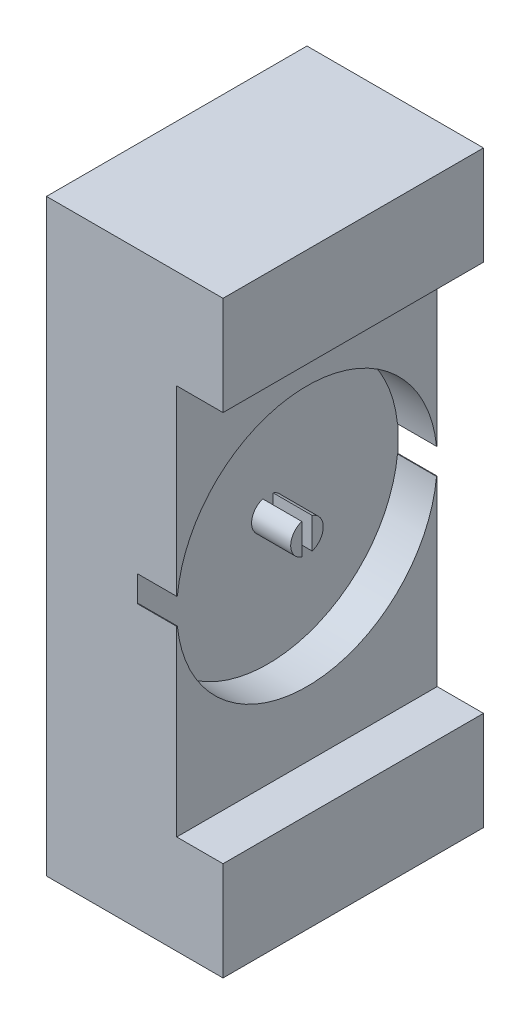
ISO-10303-21;
HEADER;
FILE_DESCRIPTION(('STEP AP214'),'2;1');
FILE_NAME('part.step','',(''),(''),'','','');
FILE_SCHEMA(('AUTOMOTIVE_DESIGN { 1 0 10303 214 1 1 1 1 }'));
ENDSEC;
DATA;
#1=APPLICATION_CONTEXT('core data for automotive mechanical design processes');
#2=APPLICATION_PROTOCOL_DEFINITION('international standard','automotive_design',2000,#1);
#3=PRODUCT_CONTEXT('',#1,'mechanical');
#4=PRODUCT('Part','Part','',(#3));
#5=PRODUCT_RELATED_PRODUCT_CATEGORY('part','',(#4));
#6=PRODUCT_DEFINITION_FORMATION('','',#4);
#7=PRODUCT_DEFINITION_CONTEXT('part definition',#1,'design');
#8=PRODUCT_DEFINITION('design','',#6,#7);
#9=PRODUCT_DEFINITION_SHAPE('','',#8);
#10=(LENGTH_UNIT() NAMED_UNIT(*) SI_UNIT(.MILLI.,.METRE.));
#11=(NAMED_UNIT(*) PLANE_ANGLE_UNIT() SI_UNIT($,.RADIAN.));
#12=(NAMED_UNIT(*) SI_UNIT($,.STERADIAN.) SOLID_ANGLE_UNIT());
#13=UNCERTAINTY_MEASURE_WITH_UNIT(LENGTH_MEASURE(1.E-05),#10,'distance_accuracy_value','');
#14=(GEOMETRIC_REPRESENTATION_CONTEXT(3) GLOBAL_UNCERTAINTY_ASSIGNED_CONTEXT((#13)) GLOBAL_UNIT_ASSIGNED_CONTEXT((#10,
#11,#12)) REPRESENTATION_CONTEXT('',''));
#15=CARTESIAN_POINT('',(0.,0.,0.));
#16=DIRECTION('',(0.,0.,1.));
#17=DIRECTION('',(1.,0.,0.));
#18=AXIS2_PLACEMENT_3D('',#15,#16,#17);
#19=CARTESIAN_POINT('',(-15.,0.,50.));
#20=DIRECTION('',(-1.,0.,0.));
#21=DIRECTION('',(0.,0.,1.));
#22=AXIS2_PLACEMENT_3D('',#19,#20,#21);
#23=PLANE('',#22);
#24=CARTESIAN_POINT('',(-15.,113.,0.));
#25=DIRECTION('',(1.,0.,0.));
#26=DIRECTION('',(0.,0.,-1.));
#27=AXIS2_PLACEMENT_3D('',#24,#25,#26);
#28=CIRCLE('',#27,6.25000000000001);
#29=CARTESIAN_POINT('',(-15.,118.921359641164,2.00000000000001));
#30=VERTEX_POINT('',#29);
#31=CARTESIAN_POINT('',(-15.,107.078640358837,2.00000000000001));
#32=VERTEX_POINT('',#31);
#33=EDGE_CURVE('E466',#30,#32,#28,.T.);
#34=ORIENTED_EDGE('',*,*,#33,.F.);
#35=DIRECTION('',(0.,-1.,0.));
#36=VECTOR('',#35,1.);
#37=CARTESIAN_POINT('',(-15.,118.921359641164,2.00000000000001));
#38=LINE('',#37,#36);
#39=EDGE_CURVE('E464',#30,#32,#38,.T.);
#40=ORIENTED_EDGE('',*,*,#39,.T.);
#41=EDGE_LOOP('',(#34,#40));
#42=FACE_BOUND('',#41,.T.);
#43=DIRECTION('',(0.,0.,-1.));
#44=VECTOR('',#43,1.);
#45=CARTESIAN_POINT('',(-15.,118.,0.));
#46=LINE('',#45,#44);
#47=CARTESIAN_POINT('',(-15.,118.,-49.749371855331));
#48=VERTEX_POINT('',#47);
#49=CARTESIAN_POINT('',(-15.,118.,-50.));
#50=VERTEX_POINT('',#49);
#51=EDGE_CURVE('E488',#48,#50,#46,.T.);
#52=ORIENTED_EDGE('',*,*,#51,.F.);
#53=CARTESIAN_POINT('',(-15.,113.,0.));
#54=DIRECTION('',(1.,0.,0.));
#55=DIRECTION('',(0.,0.,-1.));
#56=AXIS2_PLACEMENT_3D('',#53,#54,#55);
#57=CIRCLE('',#56,50.);
#58=CARTESIAN_POINT('',(-15.,118.,49.749371855331));
#59=VERTEX_POINT('',#58);
#60=EDGE_CURVE('E491',#48,#59,#57,.T.);
#61=ORIENTED_EDGE('',*,*,#60,.T.);
#62=CARTESIAN_POINT('',(-15.,118.,50.));
#63=VERTEX_POINT('',#62);
#64=EDGE_CURVE('E492',#63,#59,#46,.T.);
#65=ORIENTED_EDGE('',*,*,#64,.F.);
#66=DIRECTION('',(0.,1.,0.));
#67=VECTOR('',#66,1.);
#68=CARTESIAN_POINT('',(-15.,0.,50.));
#69=LINE('',#68,#67);
#70=CARTESIAN_POINT('',(-15.,108.,50.));
#71=VERTEX_POINT('',#70);
#72=EDGE_CURVE('E539',#71,#63,#69,.T.);
#73=ORIENTED_EDGE('',*,*,#72,.F.);
#74=DIRECTION('',(0.,0.,-1.));
#75=VECTOR('',#74,1.);
#76=CARTESIAN_POINT('',(-15.,108.,0.));
#77=LINE('',#76,#75);
#78=CARTESIAN_POINT('',(-15.,108.,49.749371855331));
#79=VERTEX_POINT('',#78);
#80=EDGE_CURVE('E525',#71,#79,#77,.T.);
#81=ORIENTED_EDGE('',*,*,#80,.T.);
#82=CARTESIAN_POINT('',(-15.,113.,0.));
#83=DIRECTION('',(1.,0.,0.));
#84=DIRECTION('',(0.,0.,-1.));
#85=AXIS2_PLACEMENT_3D('',#82,#83,#84);
#86=CIRCLE('',#85,50.);
#87=CARTESIAN_POINT('',(-15.,108.,-49.749371855331));
#88=VERTEX_POINT('',#87);
#89=EDGE_CURVE('E494',#79,#88,#86,.T.);
#90=ORIENTED_EDGE('',*,*,#89,.T.);
#91=CARTESIAN_POINT('',(-15.,108.,-50.));
#92=VERTEX_POINT('',#91);
#93=EDGE_CURVE('E511',#88,#92,#77,.T.);
#94=ORIENTED_EDGE('',*,*,#93,.T.);
#95=DIRECTION('',(0.,1.,0.));
#96=VECTOR('',#95,1.);
#97=CARTESIAN_POINT('',(-15.,0.,-50.));
#98=LINE('',#97,#96);
#99=EDGE_CURVE('E543',#92,#50,#98,.T.);
#100=ORIENTED_EDGE('',*,*,#99,.T.);
#101=EDGE_LOOP('',(#52,#61,#65,#73,#81,#90,#94,#100));
#102=FACE_BOUND('',#101,.T.);
#103=DIRECTION('',(0.,-1.,0.));
#104=VECTOR('',#103,1.);
#105=CARTESIAN_POINT('',(-15.,118.921359641164,-1.99999999999999));
#106=LINE('',#105,#104);
#107=CARTESIAN_POINT('',(-15.,118.921359641164,-1.99999999999999));
#108=VERTEX_POINT('',#107);
#109=CARTESIAN_POINT('',(-15.,107.078640358837,-1.99999999999999));
#110=VERTEX_POINT('',#109);
#111=EDGE_CURVE('E447',#108,#110,#106,.T.);
#112=ORIENTED_EDGE('',*,*,#111,.F.);
#113=CARTESIAN_POINT('',(-15.,113.,0.));
#114=DIRECTION('',(-1.,0.,0.));
#115=DIRECTION('',(0.,0.,1.));
#116=AXIS2_PLACEMENT_3D('',#113,#114,#115);
#117=CIRCLE('',#116,6.25000000000001);
#118=EDGE_CURVE('E450',#108,#110,#117,.T.);
#119=ORIENTED_EDGE('',*,*,#118,.T.);
#120=EDGE_LOOP('',(#112,#119));
#121=FACE_BOUND('',#120,.T.);
#122=ADVANCED_FACE('F250',(#42,#102,#121),#23,.F.);
#123=CARTESIAN_POINT('',(-50.,226.,-50.));
#124=DIRECTION('',(0.,0.,1.));
#125=DIRECTION('',(1.,0.,0.));
#126=AXIS2_PLACEMENT_3D('',#123,#124,#125);
#127=PLANE('',#126);
#128=DIRECTION('',(-1.,0.,0.));
#129=VECTOR('',#128,1.);
#130=CARTESIAN_POINT('',(-50.,226.,-50.));
#131=LINE('',#130,#129);
#132=CARTESIAN_POINT('',(17.7780341365237,226.,-50.));
#133=VERTEX_POINT('',#132);
#134=CARTESIAN_POINT('',(-50.,226.,-50.));
#135=VERTEX_POINT('',#134);
#136=EDGE_CURVE('E396',#133,#135,#131,.T.);
#137=ORIENTED_EDGE('',*,*,#136,.F.);
#138=DIRECTION('',(0.,-1.,0.));
#139=VECTOR('',#138,1.);
#140=CARTESIAN_POINT('',(17.7780341365237,226.,-50.));
#141=LINE('',#140,#139);
#142=CARTESIAN_POINT('',(17.7780341365237,188.,-50.));
#143=VERTEX_POINT('',#142);
#144=EDGE_CURVE('E384',#133,#143,#141,.T.);
#145=ORIENTED_EDGE('',*,*,#144,.T.);
#146=DIRECTION('',(1.,0.,0.));
#147=VECTOR('',#146,1.);
#148=CARTESIAN_POINT('',(1.48662342328725E-13,188.,-50.));
#149=LINE('',#148,#147);
#150=CARTESIAN_POINT('',(0.,188.,-50.));
#151=VERTEX_POINT('',#150);
#152=EDGE_CURVE('E412',#151,#143,#149,.T.);
#153=ORIENTED_EDGE('',*,*,#152,.F.);
#154=DIRECTION('',(0.,1.,0.));
#155=VECTOR('',#154,1.);
#156=CARTESIAN_POINT('',(0.,0.,-50.));
#157=LINE('',#156,#155);
#158=CARTESIAN_POINT('',(0.,118.,-50.));
#159=VERTEX_POINT('',#158);
#160=EDGE_CURVE('E499',#159,#151,#157,.T.);
#161=ORIENTED_EDGE('',*,*,#160,.F.);
#162=DIRECTION('',(-1.,0.,0.));
#163=VECTOR('',#162,1.);
#164=CARTESIAN_POINT('',(0.,118.,-50.));
#165=LINE('',#164,#163);
#166=EDGE_CURVE('E478',#159,#50,#165,.T.);
#167=ORIENTED_EDGE('',*,*,#166,.T.);
#168=ORIENTED_EDGE('',*,*,#99,.F.);
#169=DIRECTION('',(-1.,0.,0.));
#170=VECTOR('',#169,1.);
#171=CARTESIAN_POINT('',(0.,108.,-50.));
#172=LINE('',#171,#170);
#173=CARTESIAN_POINT('',(0.,108.,-50.));
#174=VERTEX_POINT('',#173);
#175=EDGE_CURVE('E530',#174,#92,#172,.T.);
#176=ORIENTED_EDGE('',*,*,#175,.F.);
#177=DIRECTION('',(0.,1.,0.));
#178=VECTOR('',#177,1.);
#179=CARTESIAN_POINT('',(0.,0.,-50.));
#180=LINE('',#179,#178);
#181=CARTESIAN_POINT('',(0.,38.,-50.));
#182=VERTEX_POINT('',#181);
#183=EDGE_CURVE('E521',#182,#174,#180,.T.);
#184=ORIENTED_EDGE('',*,*,#183,.F.);
#185=DIRECTION('',(-1.,0.,0.));
#186=VECTOR('',#185,1.);
#187=CARTESIAN_POINT('',(0.,38.,-50.));
#188=LINE('',#187,#186);
#189=CARTESIAN_POINT('',(17.7780341365237,38.,-50.));
#190=VERTEX_POINT('',#189);
#191=EDGE_CURVE('E536',#190,#182,#188,.T.);
#192=ORIENTED_EDGE('',*,*,#191,.F.);
#193=CARTESIAN_POINT('',(17.7780341365237,0.,-50.));
#194=VERTEX_POINT('',#193);
#195=EDGE_CURVE('E265',#190,#194,#141,.T.);
#196=ORIENTED_EDGE('',*,*,#195,.T.);
#197=DIRECTION('',(-1.,0.,0.));
#198=VECTOR('',#197,1.);
#199=CARTESIAN_POINT('',(-50.,0.,-50.));
#200=LINE('',#199,#198);
#201=CARTESIAN_POINT('',(-50.,0.,-50.));
#202=VERTEX_POINT('',#201);
#203=EDGE_CURVE('E417',#194,#202,#200,.T.);
#204=ORIENTED_EDGE('',*,*,#203,.T.);
#205=DIRECTION('',(0.,-1.,0.));
#206=VECTOR('',#205,1.);
#207=CARTESIAN_POINT('',(-50.,226.,-50.));
#208=LINE('',#207,#206);
#209=EDGE_CURVE('E258',#135,#202,#208,.T.);
#210=ORIENTED_EDGE('',*,*,#209,.F.);
#211=EDGE_LOOP('',(#137,#145,#153,#161,#167,#168,#176,#184,#192,#196,#204,#210));
#212=FACE_BOUND('',#211,.T.);
#213=ADVANCED_FACE('F252',(#212),#127,.F.);
#214=CARTESIAN_POINT('',(-50.,226.,-50.));
#215=DIRECTION('',(1.,0.,0.));
#216=DIRECTION('',(0.,0.,-1.));
#217=AXIS2_PLACEMENT_3D('',#214,#215,#216);
#218=PLANE('',#217);
#219=DIRECTION('',(0.,0.,1.));
#220=VECTOR('',#219,1.);
#221=CARTESIAN_POINT('',(-50.,0.,-50.));
#222=LINE('',#221,#220);
#223=CARTESIAN_POINT('',(-50.,0.,50.));
#224=VERTEX_POINT('',#223);
#225=EDGE_CURVE('E409',#202,#224,#222,.T.);
#226=ORIENTED_EDGE('',*,*,#225,.T.);
#227=DIRECTION('',(0.,-1.,0.));
#228=VECTOR('',#227,1.);
#229=CARTESIAN_POINT('',(-50.,226.,50.));
#230=LINE('',#229,#228);
#231=CARTESIAN_POINT('',(-50.,226.,50.));
#232=VERTEX_POINT('',#231);
#233=EDGE_CURVE('E416',#232,#224,#230,.T.);
#234=ORIENTED_EDGE('',*,*,#233,.F.);
#235=DIRECTION('',(0.,0.,1.));
#236=VECTOR('',#235,1.);
#237=CARTESIAN_POINT('',(-50.,226.,-50.));
#238=LINE('',#237,#236);
#239=EDGE_CURVE('E404',#135,#232,#238,.T.);
#240=ORIENTED_EDGE('',*,*,#239,.F.);
#241=ORIENTED_EDGE('',*,*,#209,.T.);
#242=EDGE_LOOP('',(#226,#234,#240,#241));
#243=FACE_BOUND('',#242,.T.);
#244=ADVANCED_FACE('F424',(#243),#218,.F.);
#245=CARTESIAN_POINT('',(-50.,226.,50.));
#246=DIRECTION('',(0.,0.,-1.));
#247=DIRECTION('',(-1.,0.,0.));
#248=AXIS2_PLACEMENT_3D('',#245,#246,#247);
#249=PLANE('',#248);
#250=DIRECTION('',(1.,0.,0.));
#251=VECTOR('',#250,1.);
#252=CARTESIAN_POINT('',(-50.,0.,50.));
#253=LINE('',#252,#251);
#254=CARTESIAN_POINT('',(17.7780341365237,0.,50.));
#255=VERTEX_POINT('',#254);
#256=EDGE_CURVE('E405',#224,#255,#253,.T.);
#257=ORIENTED_EDGE('',*,*,#256,.T.);
#258=DIRECTION('',(0.,-1.,0.));
#259=VECTOR('',#258,1.);
#260=CARTESIAN_POINT('',(17.7780341365237,226.,50.));
#261=LINE('',#260,#259);
#262=CARTESIAN_POINT('',(17.7780341365237,38.,50.));
#263=VERTEX_POINT('',#262);
#264=EDGE_CURVE('E434',#263,#255,#261,.T.);
#265=ORIENTED_EDGE('',*,*,#264,.F.);
#266=DIRECTION('',(-1.,0.,0.));
#267=VECTOR('',#266,1.);
#268=CARTESIAN_POINT('',(0.,38.,50.));
#269=LINE('',#268,#267);
#270=CARTESIAN_POINT('',(0.,38.,50.));
#271=VERTEX_POINT('',#270);
#272=EDGE_CURVE('E537',#263,#271,#269,.T.);
#273=ORIENTED_EDGE('',*,*,#272,.T.);
#274=DIRECTION('',(0.,1.,0.));
#275=VECTOR('',#274,1.);
#276=CARTESIAN_POINT('',(0.,0.,50.));
#277=LINE('',#276,#275);
#278=CARTESIAN_POINT('',(0.,108.,50.));
#279=VERTEX_POINT('',#278);
#280=EDGE_CURVE('E514',#271,#279,#277,.T.);
#281=ORIENTED_EDGE('',*,*,#280,.T.);
#282=DIRECTION('',(-1.,0.,0.));
#283=VECTOR('',#282,1.);
#284=CARTESIAN_POINT('',(0.,108.,50.));
#285=LINE('',#284,#283);
#286=EDGE_CURVE('E532',#279,#71,#285,.T.);
#287=ORIENTED_EDGE('',*,*,#286,.T.);
#288=ORIENTED_EDGE('',*,*,#72,.T.);
#289=DIRECTION('',(-1.,0.,0.));
#290=VECTOR('',#289,1.);
#291=CARTESIAN_POINT('',(0.,118.,50.));
#292=LINE('',#291,#290);
#293=CARTESIAN_POINT('',(0.,118.,50.));
#294=VERTEX_POINT('',#293);
#295=EDGE_CURVE('E481',#294,#63,#292,.T.);
#296=ORIENTED_EDGE('',*,*,#295,.F.);
#297=DIRECTION('',(0.,1.,0.));
#298=VECTOR('',#297,1.);
#299=CARTESIAN_POINT('',(0.,0.,50.));
#300=LINE('',#299,#298);
#301=CARTESIAN_POINT('',(0.,188.,50.));
#302=VERTEX_POINT('',#301);
#303=EDGE_CURVE('E495',#294,#302,#300,.T.);
#304=ORIENTED_EDGE('',*,*,#303,.T.);
#305=DIRECTION('',(1.,0.,0.));
#306=VECTOR('',#305,1.);
#307=CARTESIAN_POINT('',(1.48662342328725E-13,188.,50.));
#308=LINE('',#307,#306);
#309=CARTESIAN_POINT('',(17.7780341365237,188.,50.));
#310=VERTEX_POINT('',#309);
#311=EDGE_CURVE('E419',#302,#310,#308,.T.);
#312=ORIENTED_EDGE('',*,*,#311,.T.);
#313=CARTESIAN_POINT('',(17.7780341365237,226.,50.));
#314=VERTEX_POINT('',#313);
#315=EDGE_CURVE('E273',#314,#310,#261,.T.);
#316=ORIENTED_EDGE('',*,*,#315,.F.);
#317=DIRECTION('',(1.,0.,0.));
#318=VECTOR('',#317,1.);
#319=CARTESIAN_POINT('',(-50.,226.,50.));
#320=LINE('',#319,#318);
#321=EDGE_CURVE('E399',#232,#314,#320,.T.);
#322=ORIENTED_EDGE('',*,*,#321,.F.);
#323=ORIENTED_EDGE('',*,*,#233,.T.);
#324=EDGE_LOOP('',(#257,#265,#273,#281,#287,#288,#296,#304,#312,#316,#322,#323));
#325=FACE_BOUND('',#324,.T.);
#326=ADVANCED_FACE('F433',(#325),#249,.F.);
#327=CARTESIAN_POINT('',(0.,226.,0.));
#328=DIRECTION('',(0.,1.,0.));
#329=DIRECTION('',(0.,0.,1.));
#330=AXIS2_PLACEMENT_3D('',#327,#328,#329);
#331=PLANE('',#330);
#332=DIRECTION('',(0.,0.,1.));
#333=VECTOR('',#332,1.);
#334=CARTESIAN_POINT('',(17.7780341365237,226.,-50.));
#335=LINE('',#334,#333);
#336=EDGE_CURVE('E387',#133,#314,#335,.T.);
#337=ORIENTED_EDGE('',*,*,#336,.F.);
#338=ORIENTED_EDGE('',*,*,#136,.T.);
#339=ORIENTED_EDGE('',*,*,#239,.T.);
#340=ORIENTED_EDGE('',*,*,#321,.T.);
#341=EDGE_LOOP('',(#337,#338,#339,#340));
#342=FACE_BOUND('',#341,.T.);
#343=ADVANCED_FACE('F395',(#342),#331,.T.);
#344=CARTESIAN_POINT('',(0.,0.,0.));
#345=DIRECTION('',(0.,1.,0.));
#346=DIRECTION('',(0.,0.,1.));
#347=AXIS2_PLACEMENT_3D('',#344,#345,#346);
#348=PLANE('',#347);
#349=ORIENTED_EDGE('',*,*,#203,.F.);
#350=DIRECTION('',(0.,0.,1.));
#351=VECTOR('',#350,1.);
#352=CARTESIAN_POINT('',(17.7780341365237,0.,-50.));
#353=LINE('',#352,#351);
#354=EDGE_CURVE('E400',#194,#255,#353,.T.);
#355=ORIENTED_EDGE('',*,*,#354,.T.);
#356=ORIENTED_EDGE('',*,*,#256,.F.);
#357=ORIENTED_EDGE('',*,*,#225,.F.);
#358=EDGE_LOOP('',(#349,#355,#356,#357));
#359=FACE_BOUND('',#358,.T.);
#360=ADVANCED_FACE('F429',(#359),#348,.F.);
#361=CARTESIAN_POINT('',(0.,38.,50.));
#362=DIRECTION('',(0.,-1.,0.));
#363=DIRECTION('',(1.,0.,0.));
#364=AXIS2_PLACEMENT_3D('',#361,#362,#363);
#365=PLANE('',#364);
#366=ORIENTED_EDGE('',*,*,#272,.F.);
#367=DIRECTION('',(0.,0.,-1.));
#368=VECTOR('',#367,1.);
#369=CARTESIAN_POINT('',(17.7780341365237,38.,50.));
#370=LINE('',#369,#368);
#371=EDGE_CURVE('E440',#263,#190,#370,.T.);
#372=ORIENTED_EDGE('',*,*,#371,.T.);
#373=ORIENTED_EDGE('',*,*,#191,.T.);
#374=DIRECTION('',(0.,0.,-1.));
#375=VECTOR('',#374,1.);
#376=CARTESIAN_POINT('',(0.,38.,0.));
#377=LINE('',#376,#375);
#378=EDGE_CURVE('E518',#271,#182,#377,.T.);
#379=ORIENTED_EDGE('',*,*,#378,.F.);
#380=EDGE_LOOP('',(#366,#372,#373,#379));
#381=FACE_BOUND('',#380,.T.);
#382=ADVANCED_FACE('F574',(#381),#365,.F.);
#383=CARTESIAN_POINT('',(1.48662342328725E-13,188.,50.));
#384=DIRECTION('',(0.,1.,0.));
#385=DIRECTION('',(-1.,0.,0.));
#386=AXIS2_PLACEMENT_3D('',#383,#384,#385);
#387=PLANE('',#386);
#388=ORIENTED_EDGE('',*,*,#152,.T.);
#389=DIRECTION('',(0.,0.,1.));
#390=VECTOR('',#389,1.);
#391=CARTESIAN_POINT('',(17.7780341365237,188.,50.));
#392=LINE('',#391,#390);
#393=EDGE_CURVE('E12',#143,#310,#392,.T.);
#394=ORIENTED_EDGE('',*,*,#393,.T.);
#395=ORIENTED_EDGE('',*,*,#311,.F.);
#396=DIRECTION('',(0.,0.,-1.));
#397=VECTOR('',#396,1.);
#398=CARTESIAN_POINT('',(0.,188.,0.));
#399=LINE('',#398,#397);
#400=EDGE_CURVE('E497',#302,#151,#399,.T.);
#401=ORIENTED_EDGE('',*,*,#400,.T.);
#402=EDGE_LOOP('',(#388,#394,#395,#401));
#403=FACE_BOUND('',#402,.T.);
#404=ADVANCED_FACE('F548',(#403),#387,.F.);
#405=CARTESIAN_POINT('',(0.,113.,0.));
#406=DIRECTION('',(-1.,0.,0.));
#407=DIRECTION('',(0.,0.,1.));
#408=AXIS2_PLACEMENT_3D('',#405,#406,#407);
#409=CYLINDRICAL_SURFACE('',#408,50.);
#410=ORIENTED_EDGE('',*,*,#89,.F.);
#411=DIRECTION('',(-1.,0.,0.));
#412=VECTOR('',#411,1.);
#413=CARTESIAN_POINT('',(0.,108.,49.749371855331));
#414=LINE('',#413,#412);
#415=CARTESIAN_POINT('',(0.,108.,49.749371855331));
#416=VERTEX_POINT('',#415);
#417=EDGE_CURVE('E534',#416,#79,#414,.T.);
#418=ORIENTED_EDGE('',*,*,#417,.F.);
#419=CARTESIAN_POINT('',(0.,113.,0.));
#420=DIRECTION('',(1.,0.,0.));
#421=DIRECTION('',(0.,0.,-1.));
#422=AXIS2_PLACEMENT_3D('',#419,#420,#421);
#423=CIRCLE('',#422,50.);
#424=CARTESIAN_POINT('',(0.,108.,-49.749371855331));
#425=VERTEX_POINT('',#424);
#426=EDGE_CURVE('E507',#416,#425,#423,.T.);
#427=ORIENTED_EDGE('',*,*,#426,.T.);
#428=DIRECTION('',(-1.,0.,0.));
#429=VECTOR('',#428,1.);
#430=CARTESIAN_POINT('',(0.,108.,-49.749371855331));
#431=LINE('',#430,#429);
#432=EDGE_CURVE('E528',#425,#88,#431,.T.);
#433=ORIENTED_EDGE('',*,*,#432,.T.);
#434=EDGE_LOOP('',(#410,#418,#427,#433));
#435=FACE_BOUND('',#434,.T.);
#436=ADVANCED_FACE('F626',(#435),#409,.F.);
#437=CARTESIAN_POINT('',(0.,108.,0.));
#438=DIRECTION('',(0.,1.,0.));
#439=DIRECTION('',(0.,0.,1.));
#440=AXIS2_PLACEMENT_3D('',#437,#438,#439);
#441=PLANE('',#440);
#442=ORIENTED_EDGE('',*,*,#80,.F.);
#443=ORIENTED_EDGE('',*,*,#286,.F.);
#444=DIRECTION('',(0.,0.,-1.));
#445=VECTOR('',#444,1.);
#446=CARTESIAN_POINT('',(0.,108.,0.));
#447=LINE('',#446,#445);
#448=EDGE_CURVE('E510',#279,#416,#447,.T.);
#449=ORIENTED_EDGE('',*,*,#448,.T.);
#450=ORIENTED_EDGE('',*,*,#417,.T.);
#451=EDGE_LOOP('',(#442,#443,#449,#450));
#452=FACE_BOUND('',#451,.T.);
#453=ADVANCED_FACE('F632',(#452),#441,.T.);
#454=ORIENTED_EDGE('',*,*,#93,.F.);
#455=ORIENTED_EDGE('',*,*,#432,.F.);
#456=EDGE_CURVE('E515',#425,#174,#447,.T.);
#457=ORIENTED_EDGE('',*,*,#456,.T.);
#458=ORIENTED_EDGE('',*,*,#175,.T.);
#459=EDGE_LOOP('',(#454,#455,#457,#458));
#460=FACE_BOUND('',#459,.T.);
#461=ADVANCED_FACE('F566',(#460),#441,.T.);
#462=CARTESIAN_POINT('',(0.,0.,0.));
#463=DIRECTION('',(1.,0.,0.));
#464=DIRECTION('',(0.,0.,-1.));
#465=AXIS2_PLACEMENT_3D('',#462,#463,#464);
#466=PLANE('',#465);
#467=ORIENTED_EDGE('',*,*,#426,.F.);
#468=ORIENTED_EDGE('',*,*,#448,.F.);
#469=ORIENTED_EDGE('',*,*,#280,.F.);
#470=ORIENTED_EDGE('',*,*,#378,.T.);
#471=ORIENTED_EDGE('',*,*,#183,.T.);
#472=ORIENTED_EDGE('',*,*,#456,.F.);
#473=EDGE_LOOP('',(#467,#468,#469,#470,#471,#472));
#474=FACE_BOUND('',#473,.T.);
#475=ADVANCED_FACE('F569',(#474),#466,.T.);
#476=CARTESIAN_POINT('',(0.,113.,0.));
#477=DIRECTION('',(-1.,0.,0.));
#478=DIRECTION('',(0.,0.,1.));
#479=AXIS2_PLACEMENT_3D('',#476,#477,#478);
#480=CYLINDRICAL_SURFACE('',#479,50.);
#481=ORIENTED_EDGE('',*,*,#60,.F.);
#482=DIRECTION('',(-1.,0.,0.));
#483=VECTOR('',#482,1.);
#484=CARTESIAN_POINT('',(0.,118.,-49.749371855331));
#485=LINE('',#484,#483);
#486=CARTESIAN_POINT('',(0.,118.,-49.749371855331));
#487=VERTEX_POINT('',#486);
#488=EDGE_CURVE('E470',#487,#48,#485,.T.);
#489=ORIENTED_EDGE('',*,*,#488,.F.);
#490=CARTESIAN_POINT('',(0.,113.,0.));
#491=DIRECTION('',(1.,0.,0.));
#492=DIRECTION('',(0.,0.,-1.));
#493=AXIS2_PLACEMENT_3D('',#490,#491,#492);
#494=CIRCLE('',#493,50.);
#495=CARTESIAN_POINT('',(0.,118.,49.749371855331));
#496=VERTEX_POINT('',#495);
#497=EDGE_CURVE('E504',#487,#496,#494,.T.);
#498=ORIENTED_EDGE('',*,*,#497,.T.);
#499=DIRECTION('',(-1.,0.,0.));
#500=VECTOR('',#499,1.);
#501=CARTESIAN_POINT('',(0.,118.,49.749371855331));
#502=LINE('',#501,#500);
#503=EDGE_CURVE('E484',#496,#59,#502,.T.);
#504=ORIENTED_EDGE('',*,*,#503,.T.);
#505=EDGE_LOOP('',(#481,#489,#498,#504));
#506=FACE_BOUND('',#505,.T.);
#507=ADVANCED_FACE('F651',(#506),#480,.F.);
#508=CARTESIAN_POINT('',(0.,118.,0.));
#509=DIRECTION('',(0.,1.,0.));
#510=DIRECTION('',(0.,0.,1.));
#511=AXIS2_PLACEMENT_3D('',#508,#509,#510);
#512=PLANE('',#511);
#513=ORIENTED_EDGE('',*,*,#51,.T.);
#514=ORIENTED_EDGE('',*,*,#166,.F.);
#515=DIRECTION('',(0.,0.,-1.));
#516=VECTOR('',#515,1.);
#517=CARTESIAN_POINT('',(0.,118.,0.));
#518=LINE('',#517,#516);
#519=EDGE_CURVE('E502',#487,#159,#518,.T.);
#520=ORIENTED_EDGE('',*,*,#519,.F.);
#521=ORIENTED_EDGE('',*,*,#488,.T.);
#522=EDGE_LOOP('',(#513,#514,#520,#521));
#523=FACE_BOUND('',#522,.T.);
#524=ADVANCED_FACE('F558',(#523),#512,.F.);
#525=ORIENTED_EDGE('',*,*,#64,.T.);
#526=ORIENTED_EDGE('',*,*,#503,.F.);
#527=EDGE_CURVE('E487',#294,#496,#518,.T.);
#528=ORIENTED_EDGE('',*,*,#527,.F.);
#529=ORIENTED_EDGE('',*,*,#295,.T.);
#530=EDGE_LOOP('',(#525,#526,#528,#529));
#531=FACE_BOUND('',#530,.T.);
#532=ADVANCED_FACE('F665',(#531),#512,.F.);
#533=CARTESIAN_POINT('',(0.,0.,0.));
#534=DIRECTION('',(1.,0.,0.));
#535=DIRECTION('',(0.,0.,-1.));
#536=AXIS2_PLACEMENT_3D('',#533,#534,#535);
#537=PLANE('',#536);
#538=ORIENTED_EDGE('',*,*,#497,.F.);
#539=ORIENTED_EDGE('',*,*,#519,.T.);
#540=ORIENTED_EDGE('',*,*,#160,.T.);
#541=ORIENTED_EDGE('',*,*,#400,.F.);
#542=ORIENTED_EDGE('',*,*,#303,.F.);
#543=ORIENTED_EDGE('',*,*,#527,.T.);
#544=EDGE_LOOP('',(#538,#539,#540,#541,#542,#543));
#545=FACE_BOUND('',#544,.T.);
#546=ADVANCED_FACE('F553',(#545),#537,.T.);
#547=CARTESIAN_POINT('',(0.,0.,2.00000000000001));
#548=DIRECTION('',(0.,0.,-1.));
#549=DIRECTION('',(-1.,0.,0.));
#550=AXIS2_PLACEMENT_3D('',#547,#548,#549);
#551=PLANE('',#550);
#552=DIRECTION('',(-1.,0.,0.));
#553=VECTOR('',#552,1.);
#554=CARTESIAN_POINT('',(0.,107.078640358837,2.00000000000001));
#555=LINE('',#554,#553);
#556=CARTESIAN_POINT('',(0.,107.078640358837,2.00000000000001));
#557=VERTEX_POINT('',#556);
#558=EDGE_CURVE('E454',#557,#32,#555,.T.);
#559=ORIENTED_EDGE('',*,*,#558,.T.);
#560=ORIENTED_EDGE('',*,*,#39,.F.);
#561=DIRECTION('',(-1.,0.,0.));
#562=VECTOR('',#561,1.);
#563=CARTESIAN_POINT('',(0.,118.921359641164,2.00000000000001));
#564=LINE('',#563,#562);
#565=CARTESIAN_POINT('',(0.,118.921359641164,2.00000000000001));
#566=VERTEX_POINT('',#565);
#567=EDGE_CURVE('E460',#566,#30,#564,.T.);
#568=ORIENTED_EDGE('',*,*,#567,.F.);
#569=DIRECTION('',(0.,-1.,0.));
#570=VECTOR('',#569,1.);
#571=CARTESIAN_POINT('',(0.,118.921359641164,2.00000000000001));
#572=LINE('',#571,#570);
#573=EDGE_CURVE('E463',#566,#557,#572,.T.);
#574=ORIENTED_EDGE('',*,*,#573,.T.);
#575=EDGE_LOOP('',(#559,#560,#568,#574));
#576=FACE_BOUND('',#575,.T.);
#577=ADVANCED_FACE('F678',(#576),#551,.T.);
#578=CARTESIAN_POINT('',(0.,113.,0.));
#579=DIRECTION('',(-1.,0.,0.));
#580=DIRECTION('',(0.,0.,1.));
#581=AXIS2_PLACEMENT_3D('',#578,#579,#580);
#582=CYLINDRICAL_SURFACE('',#581,6.25000000000001);
#583=ORIENTED_EDGE('',*,*,#33,.T.);
#584=ORIENTED_EDGE('',*,*,#558,.F.);
#585=CARTESIAN_POINT('',(0.,113.,0.));
#586=DIRECTION('',(1.,0.,0.));
#587=DIRECTION('',(0.,0.,-1.));
#588=AXIS2_PLACEMENT_3D('',#585,#586,#587);
#589=CIRCLE('',#588,6.25000000000001);
#590=EDGE_CURVE('E467',#566,#557,#589,.T.);
#591=ORIENTED_EDGE('',*,*,#590,.F.);
#592=ORIENTED_EDGE('',*,*,#567,.T.);
#593=EDGE_LOOP('',(#583,#584,#591,#592));
#594=FACE_BOUND('',#593,.T.);
#595=ADVANCED_FACE('F685',(#594),#582,.T.);
#596=CARTESIAN_POINT('',(0.,0.,0.));
#597=DIRECTION('',(1.,0.,0.));
#598=DIRECTION('',(0.,0.,-1.));
#599=AXIS2_PLACEMENT_3D('',#596,#597,#598);
#600=PLANE('',#599);
#601=ORIENTED_EDGE('',*,*,#590,.T.);
#602=ORIENTED_EDGE('',*,*,#573,.F.);
#603=EDGE_LOOP('',(#601,#602));
#604=FACE_BOUND('',#603,.T.);
#605=ADVANCED_FACE('F693',(#604),#600,.T.);
#606=CARTESIAN_POINT('',(0.,0.,-2.00000000000002));
#607=DIRECTION('',(0.,0.,-1.));
#608=DIRECTION('',(0.,1.,0.));
#609=AXIS2_PLACEMENT_3D('',#606,#607,#608);
#610=PLANE('',#609);
#611=DIRECTION('',(-1.,0.,0.));
#612=VECTOR('',#611,1.);
#613=CARTESIAN_POINT('',(0.,118.921359641164,-1.99999999999999));
#614=LINE('',#613,#612);
#615=CARTESIAN_POINT('',(0.,118.921359641164,-1.99999999999999));
#616=VERTEX_POINT('',#615);
#617=EDGE_CURVE('E443',#616,#108,#614,.T.);
#618=ORIENTED_EDGE('',*,*,#617,.T.);
#619=ORIENTED_EDGE('',*,*,#111,.T.);
#620=DIRECTION('',(-1.,0.,0.));
#621=VECTOR('',#620,1.);
#622=CARTESIAN_POINT('',(0.,107.078640358837,-1.99999999999999));
#623=LINE('',#622,#621);
#624=CARTESIAN_POINT('',(0.,107.078640358837,-1.99999999999999));
#625=VERTEX_POINT('',#624);
#626=EDGE_CURVE('E444',#625,#110,#623,.T.);
#627=ORIENTED_EDGE('',*,*,#626,.F.);
#628=DIRECTION('',(0.,-1.,0.));
#629=VECTOR('',#628,1.);
#630=CARTESIAN_POINT('',(0.,118.921359641164,-1.99999999999999));
#631=LINE('',#630,#629);
#632=EDGE_CURVE('E446',#616,#625,#631,.T.);
#633=ORIENTED_EDGE('',*,*,#632,.F.);
#634=EDGE_LOOP('',(#618,#619,#627,#633));
#635=FACE_BOUND('',#634,.T.);
#636=ADVANCED_FACE('F701',(#635),#610,.F.);
#637=CARTESIAN_POINT('',(0.,113.,0.));
#638=DIRECTION('',(-1.,0.,0.));
#639=DIRECTION('',(0.,0.,1.));
#640=AXIS2_PLACEMENT_3D('',#637,#638,#639);
#641=CYLINDRICAL_SURFACE('',#640,6.25000000000001);
#642=ORIENTED_EDGE('',*,*,#118,.F.);
#643=ORIENTED_EDGE('',*,*,#617,.F.);
#644=CARTESIAN_POINT('',(0.,113.,0.));
#645=DIRECTION('',(-1.,0.,0.));
#646=DIRECTION('',(0.,0.,1.));
#647=AXIS2_PLACEMENT_3D('',#644,#645,#646);
#648=CIRCLE('',#647,6.25000000000001);
#649=EDGE_CURVE('E451',#616,#625,#648,.T.);
#650=ORIENTED_EDGE('',*,*,#649,.T.);
#651=ORIENTED_EDGE('',*,*,#626,.T.);
#652=EDGE_LOOP('',(#642,#643,#650,#651));
#653=FACE_BOUND('',#652,.T.);
#654=ADVANCED_FACE('F709',(#653),#641,.T.);
#655=CARTESIAN_POINT('',(0.,0.,0.));
#656=DIRECTION('',(1.,0.,0.));
#657=DIRECTION('',(0.,0.,-1.));
#658=AXIS2_PLACEMENT_3D('',#655,#656,#657);
#659=PLANE('',#658);
#660=ORIENTED_EDGE('',*,*,#649,.F.);
#661=ORIENTED_EDGE('',*,*,#632,.T.);
#662=EDGE_LOOP('',(#660,#661));
#663=FACE_BOUND('',#662,.T.);
#664=ADVANCED_FACE('F581',(#663),#659,.T.);
#665=CARTESIAN_POINT('',(17.7780341365237,226.,-50.));
#666=DIRECTION('',(-1.,0.,0.));
#667=DIRECTION('',(0.,-1.,0.));
#668=AXIS2_PLACEMENT_3D('',#665,#666,#667);
#669=PLANE('',#668);
#670=ORIENTED_EDGE('',*,*,#144,.F.);
#671=ORIENTED_EDGE('',*,*,#336,.T.);
#672=ORIENTED_EDGE('',*,*,#315,.T.);
#673=ORIENTED_EDGE('',*,*,#393,.F.);
#674=EDGE_LOOP('',(#670,#671,#672,#673));
#675=FACE_BOUND('',#674,.T.);
#676=ADVANCED_FACE('F386',(#675),#669,.F.);
#677=ORIENTED_EDGE('',*,*,#264,.T.);
#678=ORIENTED_EDGE('',*,*,#354,.F.);
#679=ORIENTED_EDGE('',*,*,#195,.F.);
#680=ORIENTED_EDGE('',*,*,#371,.F.);
#681=EDGE_LOOP('',(#677,#678,#679,#680));
#682=FACE_BOUND('',#681,.T.);
#683=ADVANCED_FACE('F575',(#682),#669,.F.);
#684=CLOSED_SHELL('',(#122,#213,#244,#326,#343,#360,#382,#404,#436,#453,#461,#475,#507,#524,
#532,#546,#577,#595,#605,#636,#654,#664,#676,#683));
#685=MANIFOLD_SOLID_BREP('B2',#684);
#686=ADVANCED_BREP_SHAPE_REPRESENTATION('',(#18,#685),#14);
#687=SHAPE_DEFINITION_REPRESENTATION(#9,#686);
ENDSEC;
END-ISO-10303-21;
